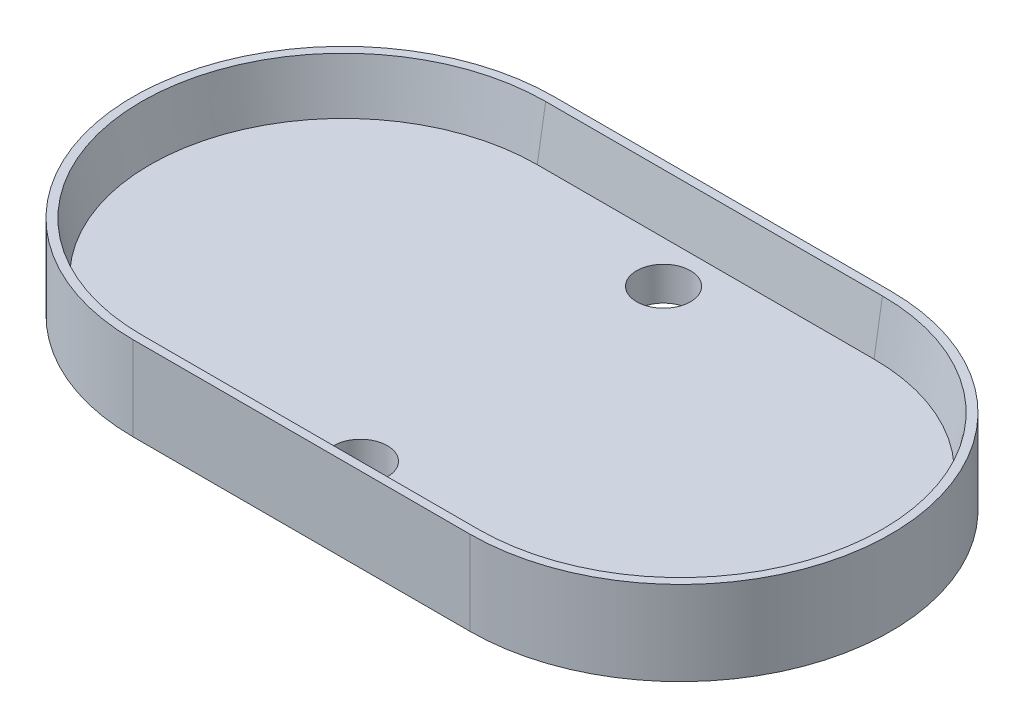
ISO-10303-21;
HEADER;
FILE_DESCRIPTION(('STEP AP214'),'2;1');
FILE_NAME('part.step','',(''),(''),'','','');
FILE_SCHEMA(('AUTOMOTIVE_DESIGN { 1 0 10303 214 1 1 1 1 }'));
ENDSEC;
DATA;
#1=APPLICATION_CONTEXT('core data for automotive mechanical design processes');
#2=APPLICATION_PROTOCOL_DEFINITION('international standard','automotive_design',2000,#1);
#3=PRODUCT_CONTEXT('',#1,'mechanical');
#4=PRODUCT('Part','Part','',(#3));
#5=PRODUCT_RELATED_PRODUCT_CATEGORY('part','',(#4));
#6=PRODUCT_DEFINITION_FORMATION('','',#4);
#7=PRODUCT_DEFINITION_CONTEXT('part definition',#1,'design');
#8=PRODUCT_DEFINITION('design','',#6,#7);
#9=PRODUCT_DEFINITION_SHAPE('','',#8);
#10=(LENGTH_UNIT() NAMED_UNIT(*) SI_UNIT(.MILLI.,.METRE.));
#11=(NAMED_UNIT(*) PLANE_ANGLE_UNIT() SI_UNIT($,.RADIAN.));
#12=(NAMED_UNIT(*) SI_UNIT($,.STERADIAN.) SOLID_ANGLE_UNIT());
#13=UNCERTAINTY_MEASURE_WITH_UNIT(LENGTH_MEASURE(1.E-05),#10,'distance_accuracy_value','');
#14=(GEOMETRIC_REPRESENTATION_CONTEXT(3) GLOBAL_UNCERTAINTY_ASSIGNED_CONTEXT((#13)) GLOBAL_UNIT_ASSIGNED_CONTEXT((#10,
#11,#12)) REPRESENTATION_CONTEXT('',''));
#15=CARTESIAN_POINT('',(0.,0.,0.));
#16=DIRECTION('',(0.,0.,1.));
#17=DIRECTION('',(1.,0.,0.));
#18=AXIS2_PLACEMENT_3D('',#15,#16,#17);
#19=CARTESIAN_POINT('',(0.,2.,12.5));
#20=DIRECTION('',(0.,0.,-1.));
#21=DIRECTION('',(-1.,0.,0.));
#22=AXIS2_PLACEMENT_3D('',#19,#20,#21);
#23=PLANE('',#22);
#24=DIRECTION('',(1.,0.,0.));
#25=VECTOR('',#24,1.);
#26=CARTESIAN_POINT('',(0.,0.,12.5));
#27=LINE('',#26,#25);
#28=CARTESIAN_POINT('',(-10.,0.,12.5));
#29=VERTEX_POINT('',#28);
#30=CARTESIAN_POINT('',(10.,0.,12.5));
#31=VERTEX_POINT('',#30);
#32=EDGE_CURVE('E159',#29,#31,#27,.T.);
#33=ORIENTED_EDGE('',*,*,#32,.T.);
#34=DIRECTION('',(0.,-1.,0.));
#35=VECTOR('',#34,1.);
#36=CARTESIAN_POINT('',(10.,2.,12.5));
#37=LINE('',#36,#35);
#38=CARTESIAN_POINT('',(10.,5.,12.5));
#39=VERTEX_POINT('',#38);
#40=EDGE_CURVE('E177',#39,#31,#37,.T.);
#41=ORIENTED_EDGE('',*,*,#40,.F.);
#42=DIRECTION('',(1.,0.,0.));
#43=VECTOR('',#42,1.);
#44=CARTESIAN_POINT('',(-10.,5.,12.5));
#45=LINE('',#44,#43);
#46=CARTESIAN_POINT('',(-10.,5.,12.5));
#47=VERTEX_POINT('',#46);
#48=EDGE_CURVE('E150',#47,#39,#45,.T.);
#49=ORIENTED_EDGE('',*,*,#48,.F.);
#50=DIRECTION('',(0.,-1.,0.));
#51=VECTOR('',#50,1.);
#52=CARTESIAN_POINT('',(-10.,2.,12.5));
#53=LINE('',#52,#51);
#54=EDGE_CURVE('E171',#47,#29,#53,.T.);
#55=ORIENTED_EDGE('',*,*,#54,.T.);
#56=EDGE_LOOP('',(#33,#41,#49,#55));
#57=FACE_BOUND('',#56,.T.);
#58=ADVANCED_FACE('F40',(#57),#23,.F.);
#59=CARTESIAN_POINT('',(10.,2.,0.));
#60=DIRECTION('',(0.,-1.,0.));
#61=DIRECTION('',(0.,0.,-1.));
#62=AXIS2_PLACEMENT_3D('',#59,#60,#61);
#63=CYLINDRICAL_SURFACE('',#62,12.5);
#64=CARTESIAN_POINT('',(10.,0.,0.));
#65=DIRECTION('',(0.,1.,0.));
#66=DIRECTION('',(0.,0.,1.));
#67=AXIS2_PLACEMENT_3D('',#64,#65,#66);
#68=CIRCLE('',#67,12.5);
#69=CARTESIAN_POINT('',(10.,0.,-12.5));
#70=VERTEX_POINT('',#69);
#71=EDGE_CURVE('E162',#31,#70,#68,.T.);
#72=ORIENTED_EDGE('',*,*,#71,.T.);
#73=DIRECTION('',(0.,-1.,0.));
#74=VECTOR('',#73,1.);
#75=CARTESIAN_POINT('',(10.,2.,-12.5));
#76=LINE('',#75,#74);
#77=CARTESIAN_POINT('',(10.,5.,-12.5));
#78=VERTEX_POINT('',#77);
#79=EDGE_CURVE('E175',#78,#70,#76,.T.);
#80=ORIENTED_EDGE('',*,*,#79,.F.);
#81=CARTESIAN_POINT('',(10.,5.,0.));
#82=DIRECTION('',(0.,1.,0.));
#83=DIRECTION('',(0.,0.,1.));
#84=AXIS2_PLACEMENT_3D('',#81,#82,#83);
#85=CIRCLE('',#84,12.5);
#86=EDGE_CURVE('E153',#39,#78,#85,.T.);
#87=ORIENTED_EDGE('',*,*,#86,.F.);
#88=ORIENTED_EDGE('',*,*,#40,.T.);
#89=EDGE_LOOP('',(#72,#80,#87,#88));
#90=FACE_BOUND('',#89,.T.);
#91=ADVANCED_FACE('F199',(#90),#63,.T.);
#92=CARTESIAN_POINT('',(0.,2.,-12.5));
#93=DIRECTION('',(0.,0.,-1.));
#94=DIRECTION('',(-1.,0.,0.));
#95=AXIS2_PLACEMENT_3D('',#92,#93,#94);
#96=PLANE('',#95);
#97=DIRECTION('',(1.,0.,0.));
#98=VECTOR('',#97,1.);
#99=CARTESIAN_POINT('',(0.,0.,-12.5));
#100=LINE('',#99,#98);
#101=CARTESIAN_POINT('',(-10.,0.,-12.5));
#102=VERTEX_POINT('',#101);
#103=EDGE_CURVE('E165',#102,#70,#100,.T.);
#104=ORIENTED_EDGE('',*,*,#103,.F.);
#105=DIRECTION('',(0.,-1.,0.));
#106=VECTOR('',#105,1.);
#107=CARTESIAN_POINT('',(-10.,2.,-12.5));
#108=LINE('',#107,#106);
#109=CARTESIAN_POINT('',(-10.,5.,-12.5));
#110=VERTEX_POINT('',#109);
#111=EDGE_CURVE('E173',#110,#102,#108,.T.);
#112=ORIENTED_EDGE('',*,*,#111,.F.);
#113=DIRECTION('',(-1.,0.,0.));
#114=VECTOR('',#113,1.);
#115=CARTESIAN_POINT('',(10.,5.,-12.5));
#116=LINE('',#115,#114);
#117=EDGE_CURVE('E156',#78,#110,#116,.T.);
#118=ORIENTED_EDGE('',*,*,#117,.F.);
#119=ORIENTED_EDGE('',*,*,#79,.T.);
#120=EDGE_LOOP('',(#104,#112,#118,#119));
#121=FACE_BOUND('',#120,.T.);
#122=ADVANCED_FACE('F205',(#121),#96,.T.);
#123=CARTESIAN_POINT('',(-10.,2.,0.));
#124=DIRECTION('',(0.,-1.,0.));
#125=DIRECTION('',(0.,0.,-1.));
#126=AXIS2_PLACEMENT_3D('',#123,#124,#125);
#127=CYLINDRICAL_SURFACE('',#126,12.5);
#128=CARTESIAN_POINT('',(-10.,0.,0.));
#129=DIRECTION('',(0.,1.,0.));
#130=DIRECTION('',(0.,0.,1.));
#131=AXIS2_PLACEMENT_3D('',#128,#129,#130);
#132=CIRCLE('',#131,12.5);
#133=EDGE_CURVE('E168',#29,#102,#132,.F.);
#134=ORIENTED_EDGE('',*,*,#133,.F.);
#135=ORIENTED_EDGE('',*,*,#54,.F.);
#136=CARTESIAN_POINT('',(-10.,5.,0.));
#137=DIRECTION('',(0.,1.,0.));
#138=DIRECTION('',(0.,0.,1.));
#139=AXIS2_PLACEMENT_3D('',#136,#137,#138);
#140=CIRCLE('',#139,12.5);
#141=EDGE_CURVE('E122',#110,#47,#140,.T.);
#142=ORIENTED_EDGE('',*,*,#141,.F.);
#143=ORIENTED_EDGE('',*,*,#111,.T.);
#144=EDGE_LOOP('',(#134,#135,#142,#143));
#145=FACE_BOUND('',#144,.T.);
#146=ADVANCED_FACE('F242',(#145),#127,.T.);
#147=CARTESIAN_POINT('',(0.,0.,0.));
#148=DIRECTION('',(0.,1.,0.));
#149=DIRECTION('',(0.,0.,1.));
#150=AXIS2_PLACEMENT_3D('',#147,#148,#149);
#151=PLANE('',#150);
#152=CARTESIAN_POINT('',(0.,0.,-9.));
#153=DIRECTION('',(0.,-1.,0.));
#154=DIRECTION('',(0.,0.,-1.));
#155=AXIS2_PLACEMENT_3D('',#152,#153,#154);
#156=CIRCLE('',#155,1.6);
#157=CARTESIAN_POINT('',(0.,0.,-10.6));
#158=VERTEX_POINT('',#157);
#159=EDGE_CURVE('E134',#158,#158,#156,.T.);
#160=ORIENTED_EDGE('',*,*,#159,.F.);
#161=EDGE_LOOP('',(#160));
#162=FACE_BOUND('',#161,.T.);
#163=CARTESIAN_POINT('',(0.,0.,9.00000000000001));
#164=DIRECTION('',(0.,-1.,0.));
#165=DIRECTION('',(0.,0.,-1.));
#166=AXIS2_PLACEMENT_3D('',#163,#164,#165);
#167=CIRCLE('',#166,1.6);
#168=CARTESIAN_POINT('',(0.,0.,7.4));
#169=VERTEX_POINT('',#168);
#170=EDGE_CURVE('E139',#169,#169,#167,.T.);
#171=ORIENTED_EDGE('',*,*,#170,.F.);
#172=EDGE_LOOP('',(#171));
#173=FACE_BOUND('',#172,.T.);
#174=ORIENTED_EDGE('',*,*,#32,.F.);
#175=ORIENTED_EDGE('',*,*,#133,.T.);
#176=ORIENTED_EDGE('',*,*,#103,.T.);
#177=ORIENTED_EDGE('',*,*,#71,.F.);
#178=EDGE_LOOP('',(#174,#175,#176,#177));
#179=FACE_BOUND('',#178,.T.);
#180=ADVANCED_FACE('F236',(#162,#173,#179),#151,.F.);
#181=CARTESIAN_POINT('',(-10.,5.,0.));
#182=DIRECTION('',(0.,1.,0.));
#183=DIRECTION('',(0.,0.,1.));
#184=AXIS2_PLACEMENT_3D('',#181,#182,#183);
#185=PLANE('',#184);
#186=CARTESIAN_POINT('',(10.,5.,0.));
#187=DIRECTION('',(0.,1.,0.));
#188=DIRECTION('',(0.,0.,1.));
#189=AXIS2_PLACEMENT_3D('',#186,#187,#188);
#190=CIRCLE('',#189,12.);
#191=CARTESIAN_POINT('',(10.,5.,-12.));
#192=VERTEX_POINT('',#191);
#193=CARTESIAN_POINT('',(10.,5.,12.));
#194=VERTEX_POINT('',#193);
#195=EDGE_CURVE('E50',#192,#194,#190,.F.);
#196=ORIENTED_EDGE('',*,*,#195,.T.);
#197=DIRECTION('',(-1.,0.,0.));
#198=VECTOR('',#197,1.);
#199=CARTESIAN_POINT('',(-10.,5.,12.));
#200=LINE('',#199,#198);
#201=CARTESIAN_POINT('',(-10.,5.,12.));
#202=VERTEX_POINT('',#201);
#203=EDGE_CURVE('E11',#194,#202,#200,.T.);
#204=ORIENTED_EDGE('',*,*,#203,.T.);
#205=CARTESIAN_POINT('',(-10.,5.,0.));
#206=DIRECTION('',(0.,1.,0.));
#207=DIRECTION('',(0.,0.,1.));
#208=AXIS2_PLACEMENT_3D('',#205,#206,#207);
#209=CIRCLE('',#208,12.);
#210=CARTESIAN_POINT('',(-10.,5.,-12.));
#211=VERTEX_POINT('',#210);
#212=EDGE_CURVE('E180',#202,#211,#209,.F.);
#213=ORIENTED_EDGE('',*,*,#212,.T.);
#214=DIRECTION('',(1.,0.,0.));
#215=VECTOR('',#214,1.);
#216=CARTESIAN_POINT('',(-10.,5.,-12.));
#217=LINE('',#216,#215);
#218=EDGE_CURVE('E61',#211,#192,#217,.T.);
#219=ORIENTED_EDGE('',*,*,#218,.T.);
#220=EDGE_LOOP('',(#196,#204,#213,#219));
#221=FACE_BOUND('',#220,.T.);
#222=ORIENTED_EDGE('',*,*,#141,.T.);
#223=ORIENTED_EDGE('',*,*,#48,.T.);
#224=ORIENTED_EDGE('',*,*,#86,.T.);
#225=ORIENTED_EDGE('',*,*,#117,.T.);
#226=EDGE_LOOP('',(#222,#223,#224,#225));
#227=FACE_BOUND('',#226,.T.);
#228=ADVANCED_FACE('F187',(#221,#227),#185,.T.);
#229=CARTESIAN_POINT('',(0.,2.,0.));
#230=DIRECTION('',(0.,1.,0.));
#231=DIRECTION('',(0.,0.,1.));
#232=AXIS2_PLACEMENT_3D('',#229,#230,#231);
#233=PLANE('',#232);
#234=CARTESIAN_POINT('',(0.,2.,-9.));
#235=DIRECTION('',(0.,1.,0.));
#236=DIRECTION('',(0.,0.,1.));
#237=AXIS2_PLACEMENT_3D('',#234,#235,#236);
#238=CIRCLE('',#237,1.6);
#239=CARTESIAN_POINT('',(0.,2.,-7.4));
#240=VERTEX_POINT('',#239);
#241=EDGE_CURVE('E45',#240,#240,#238,.T.);
#242=ORIENTED_EDGE('',*,*,#241,.F.);
#243=EDGE_LOOP('',(#242));
#244=FACE_BOUND('',#243,.T.);
#245=CARTESIAN_POINT('',(0.,2.,9.00000000000001));
#246=DIRECTION('',(0.,1.,0.));
#247=DIRECTION('',(0.,0.,1.));
#248=AXIS2_PLACEMENT_3D('',#245,#246,#247);
#249=CIRCLE('',#248,1.6);
#250=CARTESIAN_POINT('',(0.,2.,10.6));
#251=VERTEX_POINT('',#250);
#252=EDGE_CURVE('E132',#251,#251,#249,.T.);
#253=ORIENTED_EDGE('',*,*,#252,.F.);
#254=EDGE_LOOP('',(#253));
#255=FACE_BOUND('',#254,.T.);
#256=CARTESIAN_POINT('',(-10.,2.,0.));
#257=DIRECTION('',(0.,1.,0.));
#258=DIRECTION('',(0.,0.,1.));
#259=AXIS2_PLACEMENT_3D('',#256,#257,#258);
#260=CIRCLE('',#259,11.5);
#261=CARTESIAN_POINT('',(-10.,2.,-11.5));
#262=VERTEX_POINT('',#261);
#263=CARTESIAN_POINT('',(-10.,2.,11.5));
#264=VERTEX_POINT('',#263);
#265=EDGE_CURVE('E127',#262,#264,#260,.T.);
#266=ORIENTED_EDGE('',*,*,#265,.T.);
#267=DIRECTION('',(1.,0.,0.));
#268=VECTOR('',#267,1.);
#269=CARTESIAN_POINT('',(-10.,2.,11.5));
#270=LINE('',#269,#268);
#271=CARTESIAN_POINT('',(10.,2.,11.5));
#272=VERTEX_POINT('',#271);
#273=EDGE_CURVE('E112',#264,#272,#270,.T.);
#274=ORIENTED_EDGE('',*,*,#273,.T.);
#275=CARTESIAN_POINT('',(10.,2.,0.));
#276=DIRECTION('',(0.,1.,0.));
#277=DIRECTION('',(0.,0.,1.));
#278=AXIS2_PLACEMENT_3D('',#275,#276,#277);
#279=CIRCLE('',#278,11.5);
#280=CARTESIAN_POINT('',(10.,2.,-11.5));
#281=VERTEX_POINT('',#280);
#282=EDGE_CURVE('E106',#272,#281,#279,.T.);
#283=ORIENTED_EDGE('',*,*,#282,.T.);
#284=DIRECTION('',(-1.,0.,0.));
#285=VECTOR('',#284,1.);
#286=CARTESIAN_POINT('',(10.,2.,-11.5));
#287=LINE('',#286,#285);
#288=EDGE_CURVE('E109',#281,#262,#287,.T.);
#289=ORIENTED_EDGE('',*,*,#288,.T.);
#290=EDGE_LOOP('',(#266,#274,#283,#289));
#291=FACE_BOUND('',#290,.T.);
#292=ADVANCED_FACE('F108',(#244,#255,#291),#233,.T.);
#293=CARTESIAN_POINT('',(10.,1.99999999999987,-11.5));
#294=DIRECTION('',(0.,-0.164398987305354,-0.986393923832144));
#295=DIRECTION('',(-1.,0.,0.));
#296=AXIS2_PLACEMENT_3D('',#293,#294,#295);
#297=PLANE('',#296);
#298=DIRECTION('',(0.,-0.986393923832144,0.164398987305354));
#299=VECTOR('',#298,1.);
#300=CARTESIAN_POINT('',(10.,5.,-12.));
#301=LINE('',#300,#299);
#302=EDGE_CURVE('E118',#192,#281,#301,.T.);
#303=ORIENTED_EDGE('',*,*,#302,.F.);
#304=ORIENTED_EDGE('',*,*,#218,.F.);
#305=DIRECTION('',(0.,0.986393923832144,-0.164398987305354));
#306=VECTOR('',#305,1.);
#307=CARTESIAN_POINT('',(-10.,1.99999999999987,-11.5));
#308=LINE('',#307,#306);
#309=EDGE_CURVE('E120',#262,#211,#308,.T.);
#310=ORIENTED_EDGE('',*,*,#309,.F.);
#311=ORIENTED_EDGE('',*,*,#288,.F.);
#312=EDGE_LOOP('',(#303,#304,#310,#311));
#313=FACE_BOUND('',#312,.T.);
#314=ADVANCED_FACE('F43',(#313),#297,.F.);
#315=CARTESIAN_POINT('',(-10.,1.99999999999987,0.));
#316=DIRECTION('',(0.,1.,0.));
#317=DIRECTION('',(0.,0.,1.));
#318=AXIS2_PLACEMENT_3D('',#315,#316,#317);
#319=CONICAL_SURFACE('',#318,11.5,0.165148677414623);
#320=ORIENTED_EDGE('',*,*,#309,.T.);
#321=ORIENTED_EDGE('',*,*,#212,.F.);
#322=DIRECTION('',(0.,0.986393923832144,0.164398987305354));
#323=VECTOR('',#322,1.);
#324=CARTESIAN_POINT('',(-10.,1.99999999999987,11.5));
#325=LINE('',#324,#323);
#326=EDGE_CURVE('E125',#264,#202,#325,.T.);
#327=ORIENTED_EDGE('',*,*,#326,.F.);
#328=ORIENTED_EDGE('',*,*,#265,.F.);
#329=EDGE_LOOP('',(#320,#321,#327,#328));
#330=FACE_BOUND('',#329,.T.);
#331=ADVANCED_FACE('F190',(#330),#319,.F.);
#332=CARTESIAN_POINT('',(10.,1.99999999999987,0.));
#333=DIRECTION('',(0.,1.,0.));
#334=DIRECTION('',(0.,0.,1.));
#335=AXIS2_PLACEMENT_3D('',#332,#333,#334);
#336=CONICAL_SURFACE('',#335,11.5,0.165148677414623);
#337=ORIENTED_EDGE('',*,*,#302,.T.);
#338=ORIENTED_EDGE('',*,*,#282,.F.);
#339=DIRECTION('',(0.,-0.986393923832144,-0.164398987305354));
#340=VECTOR('',#339,1.);
#341=CARTESIAN_POINT('',(10.,5.,12.));
#342=LINE('',#341,#340);
#343=EDGE_CURVE('E129',#194,#272,#342,.T.);
#344=ORIENTED_EDGE('',*,*,#343,.F.);
#345=ORIENTED_EDGE('',*,*,#195,.F.);
#346=EDGE_LOOP('',(#337,#338,#344,#345));
#347=FACE_BOUND('',#346,.T.);
#348=ADVANCED_FACE('F124',(#347),#336,.F.);
#349=CARTESIAN_POINT('',(-10.,1.99999999999987,11.5));
#350=DIRECTION('',(0.,-0.164398987305354,0.986393923832144));
#351=DIRECTION('',(1.,0.,0.));
#352=AXIS2_PLACEMENT_3D('',#349,#350,#351);
#353=PLANE('',#352);
#354=ORIENTED_EDGE('',*,*,#326,.T.);
#355=ORIENTED_EDGE('',*,*,#203,.F.);
#356=ORIENTED_EDGE('',*,*,#343,.T.);
#357=ORIENTED_EDGE('',*,*,#273,.F.);
#358=EDGE_LOOP('',(#354,#355,#356,#357));
#359=FACE_BOUND('',#358,.T.);
#360=ADVANCED_FACE('F184',(#359),#353,.F.);
#361=CARTESIAN_POINT('',(0.,5.,9.00000000000001));
#362=DIRECTION('',(0.,-1.,0.));
#363=DIRECTION('',(0.,0.,-1.));
#364=AXIS2_PLACEMENT_3D('',#361,#362,#363);
#365=CYLINDRICAL_SURFACE('',#364,1.6);
#366=ORIENTED_EDGE('',*,*,#252,.T.);
#367=EDGE_LOOP('',(#366));
#368=FACE_BOUND('',#367,.T.);
#369=ORIENTED_EDGE('',*,*,#170,.T.);
#370=EDGE_LOOP('',(#369));
#371=FACE_BOUND('',#370,.T.);
#372=ADVANCED_FACE('F215',(#368,#371),#365,.F.);
#373=CARTESIAN_POINT('',(0.,5.,-9.));
#374=DIRECTION('',(0.,-1.,0.));
#375=DIRECTION('',(0.,0.,-1.));
#376=AXIS2_PLACEMENT_3D('',#373,#374,#375);
#377=CYLINDRICAL_SURFACE('',#376,1.6);
#378=ORIENTED_EDGE('',*,*,#241,.T.);
#379=EDGE_LOOP('',(#378));
#380=FACE_BOUND('',#379,.T.);
#381=ORIENTED_EDGE('',*,*,#159,.T.);
#382=EDGE_LOOP('',(#381));
#383=FACE_BOUND('',#382,.T.);
#384=ADVANCED_FACE('F225',(#380,#383),#377,.F.);
#385=CLOSED_SHELL('',(#58,#91,#122,#146,#180,#228,#292,#314,#331,#348,#360,#372,#384));
#386=MANIFOLD_SOLID_BREP('B2',#385);
#387=ADVANCED_BREP_SHAPE_REPRESENTATION('',(#18,#386),#14);
#388=SHAPE_DEFINITION_REPRESENTATION(#9,#387);
ENDSEC;
END-ISO-10303-21;
